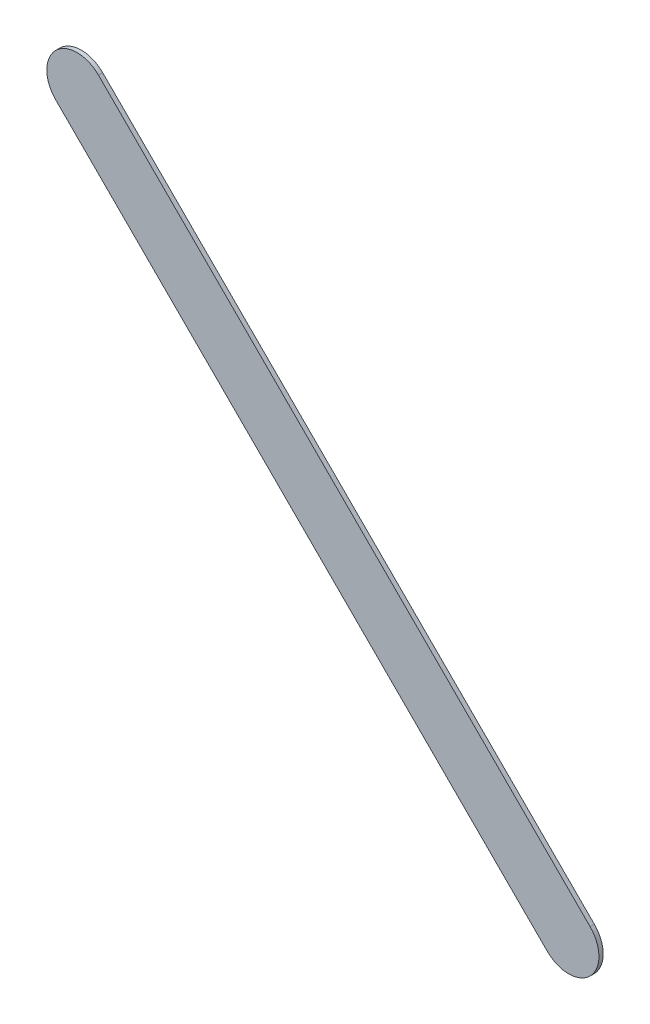
ISO-10303-21;
HEADER;
FILE_DESCRIPTION(('STEP AP214'),'2;1');
FILE_NAME('part.step','',(''),(''),'','','');
FILE_SCHEMA(('AUTOMOTIVE_DESIGN { 1 0 10303 214 1 1 1 1 }'));
ENDSEC;
DATA;
#1=APPLICATION_CONTEXT('core data for automotive mechanical design processes');
#2=APPLICATION_PROTOCOL_DEFINITION('international standard','automotive_design',2000,#1);
#3=PRODUCT_CONTEXT('',#1,'mechanical');
#4=PRODUCT('Part','Part','',(#3));
#5=PRODUCT_RELATED_PRODUCT_CATEGORY('part','',(#4));
#6=PRODUCT_DEFINITION_FORMATION('','',#4);
#7=PRODUCT_DEFINITION_CONTEXT('part definition',#1,'design');
#8=PRODUCT_DEFINITION('design','',#6,#7);
#9=PRODUCT_DEFINITION_SHAPE('','',#8);
#10=(LENGTH_UNIT() NAMED_UNIT(*) SI_UNIT(.MILLI.,.METRE.));
#11=(NAMED_UNIT(*) PLANE_ANGLE_UNIT() SI_UNIT($,.RADIAN.));
#12=(NAMED_UNIT(*) SI_UNIT($,.STERADIAN.) SOLID_ANGLE_UNIT());
#13=UNCERTAINTY_MEASURE_WITH_UNIT(LENGTH_MEASURE(1.E-05),#10,'distance_accuracy_value','');
#14=(GEOMETRIC_REPRESENTATION_CONTEXT(3) GLOBAL_UNCERTAINTY_ASSIGNED_CONTEXT((#13)) GLOBAL_UNIT_ASSIGNED_CONTEXT((#10,
#11,#12)) REPRESENTATION_CONTEXT('',''));
#15=CARTESIAN_POINT('',(0.,0.,0.));
#16=DIRECTION('',(0.,0.,1.));
#17=DIRECTION('',(1.,0.,0.));
#18=AXIS2_PLACEMENT_3D('',#15,#16,#17);
#19=CARTESIAN_POINT('',(161.720776,-86.691223,0.));
#20=DIRECTION('',(0.,0.,1.));
#21=DIRECTION('',(1.,0.,0.));
#22=AXIS2_PLACEMENT_3D('',#19,#20,#21);
#23=PLANE('',#22);
#24=DIRECTION('',(-0.707106781186548,0.707106781186548,0.));
#25=VECTOR('',#24,1.);
#26=CARTESIAN_POINT('',(161.720776,-86.691223,0.));
#27=LINE('',#26,#25);
#28=CARTESIAN_POINT('',(161.720776,-86.691223,0.));
#29=VERTEX_POINT('',#28);
#30=CARTESIAN_POINT('',(157.656776,-82.627223,0.));
#31=VERTEX_POINT('',#30);
#32=EDGE_CURVE('E94',#29,#31,#27,.T.);
#33=ORIENTED_EDGE('',*,*,#32,.T.);
#34=CARTESIAN_POINT('',(157.4799995,-82.8039995,0.));
#35=DIRECTION('',(0.,0.,1.));
#36=DIRECTION('',(0.707106781186548,0.707106781186548,0.));
#37=AXIS2_PLACEMENT_3D('',#34,#35,#36);
#38=CIRCLE('',#37,0.249999723809);
#39=CARTESIAN_POINT('',(157.303223,-82.980776,0.));
#40=VERTEX_POINT('',#39);
#41=EDGE_CURVE('E73',#31,#40,#38,.T.);
#42=ORIENTED_EDGE('',*,*,#41,.T.);
#43=DIRECTION('',(0.707106781186548,-0.707106781186548,0.));
#44=VECTOR('',#43,1.);
#45=CARTESIAN_POINT('',(157.303223,-82.980776,0.));
#46=LINE('',#45,#44);
#47=CARTESIAN_POINT('',(161.367223,-87.044776,0.));
#48=VERTEX_POINT('',#47);
#49=EDGE_CURVE('E20',#40,#48,#46,.T.);
#50=ORIENTED_EDGE('',*,*,#49,.T.);
#51=CARTESIAN_POINT('',(161.5439995,-86.8679995,0.));
#52=DIRECTION('',(0.,0.,1.));
#53=DIRECTION('',(-0.707106781186548,-0.707106781186548,0.));
#54=AXIS2_PLACEMENT_3D('',#51,#52,#53);
#55=CIRCLE('',#54,0.249999723809);
#56=EDGE_CURVE('E11',#48,#29,#55,.T.);
#57=ORIENTED_EDGE('',*,*,#56,.T.);
#58=EDGE_LOOP('',(#33,#42,#50,#57));
#59=FACE_BOUND('',#58,.T.);
#60=ADVANCED_FACE('F17',(#59),#23,.T.);
#61=CARTESIAN_POINT('',(161.720776,-86.691223,-0.035));
#62=DIRECTION('',(0.,0.,1.));
#63=DIRECTION('',(1.,0.,0.));
#64=AXIS2_PLACEMENT_3D('',#61,#62,#63);
#65=PLANE('',#64);
#66=CARTESIAN_POINT('',(161.5439995,-86.8679995,-0.035));
#67=DIRECTION('',(0.,0.,1.));
#68=DIRECTION('',(-0.707106781186548,-0.707106781186548,0.));
#69=AXIS2_PLACEMENT_3D('',#66,#67,#68);
#70=CIRCLE('',#69,0.249999723809);
#71=CARTESIAN_POINT('',(161.367223,-87.044776,-0.035));
#72=VERTEX_POINT('',#71);
#73=CARTESIAN_POINT('',(161.720776,-86.691223,-0.035));
#74=VERTEX_POINT('',#73);
#75=EDGE_CURVE('E26',#72,#74,#70,.T.);
#76=ORIENTED_EDGE('',*,*,#75,.F.);
#77=DIRECTION('',(0.707106781186548,-0.707106781186548,0.));
#78=VECTOR('',#77,1.);
#79=CARTESIAN_POINT('',(157.303223,-82.980776,-0.035));
#80=LINE('',#79,#78);
#81=CARTESIAN_POINT('',(157.303223,-82.980776,-0.035));
#82=VERTEX_POINT('',#81);
#83=EDGE_CURVE('E62',#82,#72,#80,.T.);
#84=ORIENTED_EDGE('',*,*,#83,.F.);
#85=CARTESIAN_POINT('',(157.4799995,-82.8039995,-0.035));
#86=DIRECTION('',(0.,0.,1.));
#87=DIRECTION('',(0.707106781186548,0.707106781186548,0.));
#88=AXIS2_PLACEMENT_3D('',#85,#86,#87);
#89=CIRCLE('',#88,0.249999723809);
#90=CARTESIAN_POINT('',(157.656776,-82.627223,-0.035));
#91=VERTEX_POINT('',#90);
#92=EDGE_CURVE('E67',#91,#82,#89,.T.);
#93=ORIENTED_EDGE('',*,*,#92,.F.);
#94=DIRECTION('',(-0.707106781186548,0.707106781186548,0.));
#95=VECTOR('',#94,1.);
#96=CARTESIAN_POINT('',(161.720776,-86.691223,-0.035));
#97=LINE('',#96,#95);
#98=EDGE_CURVE('E98',#74,#91,#97,.T.);
#99=ORIENTED_EDGE('',*,*,#98,.F.);
#100=EDGE_LOOP('',(#76,#84,#93,#99));
#101=FACE_BOUND('',#100,.T.);
#102=ADVANCED_FACE('F64',(#101),#65,.F.);
#103=CARTESIAN_POINT('',(161.5439995,-86.8679995,-0.035));
#104=DIRECTION('',(0.,0.,-1.));
#105=DIRECTION('',(-0.707106781186548,-0.707106781186548,0.));
#106=AXIS2_PLACEMENT_3D('',#103,#104,#105);
#107=CYLINDRICAL_SURFACE('',#106,0.249999723809);
#108=ORIENTED_EDGE('',*,*,#75,.T.);
#109=DIRECTION('',(0.,0.,1.));
#110=VECTOR('',#109,1.);
#111=CARTESIAN_POINT('',(161.720776,-86.691223,-0.035));
#112=LINE('',#111,#110);
#113=EDGE_CURVE('E88',#74,#29,#112,.T.);
#114=ORIENTED_EDGE('',*,*,#113,.T.);
#115=ORIENTED_EDGE('',*,*,#56,.F.);
#116=DIRECTION('',(0.,0.,1.));
#117=VECTOR('',#116,1.);
#118=CARTESIAN_POINT('',(161.367223,-87.044776,-0.035));
#119=LINE('',#118,#117);
#120=EDGE_CURVE('E72',#72,#48,#119,.T.);
#121=ORIENTED_EDGE('',*,*,#120,.F.);
#122=EDGE_LOOP('',(#108,#114,#115,#121));
#123=FACE_BOUND('',#122,.T.);
#124=ADVANCED_FACE('F118',(#123),#107,.T.);
#125=CARTESIAN_POINT('',(157.303223,-82.980776,-0.035));
#126=DIRECTION('',(0.707106781186548,0.707106781186548,0.));
#127=DIRECTION('',(0.,0.,-1.));
#128=AXIS2_PLACEMENT_3D('',#125,#126,#127);
#129=PLANE('',#128);
#130=ORIENTED_EDGE('',*,*,#83,.T.);
#131=ORIENTED_EDGE('',*,*,#120,.T.);
#132=ORIENTED_EDGE('',*,*,#49,.F.);
#133=DIRECTION('',(0.,0.,1.));
#134=VECTOR('',#133,1.);
#135=CARTESIAN_POINT('',(157.303223,-82.980776,-0.035));
#136=LINE('',#135,#134);
#137=EDGE_CURVE('E76',#82,#40,#136,.T.);
#138=ORIENTED_EDGE('',*,*,#137,.F.);
#139=EDGE_LOOP('',(#130,#131,#132,#138));
#140=FACE_BOUND('',#139,.T.);
#141=ADVANCED_FACE('F77',(#140),#129,.F.);
#142=CARTESIAN_POINT('',(157.4799995,-82.8039995,-0.035));
#143=DIRECTION('',(0.,0.,-1.));
#144=DIRECTION('',(0.707106781186548,0.707106781186548,0.));
#145=AXIS2_PLACEMENT_3D('',#142,#143,#144);
#146=CYLINDRICAL_SURFACE('',#145,0.249999723809);
#147=ORIENTED_EDGE('',*,*,#92,.T.);
#148=ORIENTED_EDGE('',*,*,#137,.T.);
#149=ORIENTED_EDGE('',*,*,#41,.F.);
#150=DIRECTION('',(0.,0.,1.));
#151=VECTOR('',#150,1.);
#152=CARTESIAN_POINT('',(157.656776,-82.627223,-0.035));
#153=LINE('',#152,#151);
#154=EDGE_CURVE('E85',#91,#31,#153,.T.);
#155=ORIENTED_EDGE('',*,*,#154,.F.);
#156=EDGE_LOOP('',(#147,#148,#149,#155));
#157=FACE_BOUND('',#156,.T.);
#158=ADVANCED_FACE('F83',(#157),#146,.T.);
#159=CARTESIAN_POINT('',(161.720776,-86.691223,-0.035));
#160=DIRECTION('',(-0.707106781186548,-0.707106781186548,0.));
#161=DIRECTION('',(-0.707106781186548,0.707106781186548,0.));
#162=AXIS2_PLACEMENT_3D('',#159,#160,#161);
#163=PLANE('',#162);
#164=ORIENTED_EDGE('',*,*,#98,.T.);
#165=ORIENTED_EDGE('',*,*,#154,.T.);
#166=ORIENTED_EDGE('',*,*,#32,.F.);
#167=ORIENTED_EDGE('',*,*,#113,.F.);
#168=EDGE_LOOP('',(#164,#165,#166,#167));
#169=FACE_BOUND('',#168,.T.);
#170=ADVANCED_FACE('F123',(#169),#163,.F.);
#171=CLOSED_SHELL('',(#60,#102,#124,#141,#158,#170));
#172=MANIFOLD_SOLID_BREP('B1',#171);
#173=ADVANCED_BREP_SHAPE_REPRESENTATION('',(#18,#172),#14);
#174=SHAPE_DEFINITION_REPRESENTATION(#9,#173);
ENDSEC;
END-ISO-10303-21;
